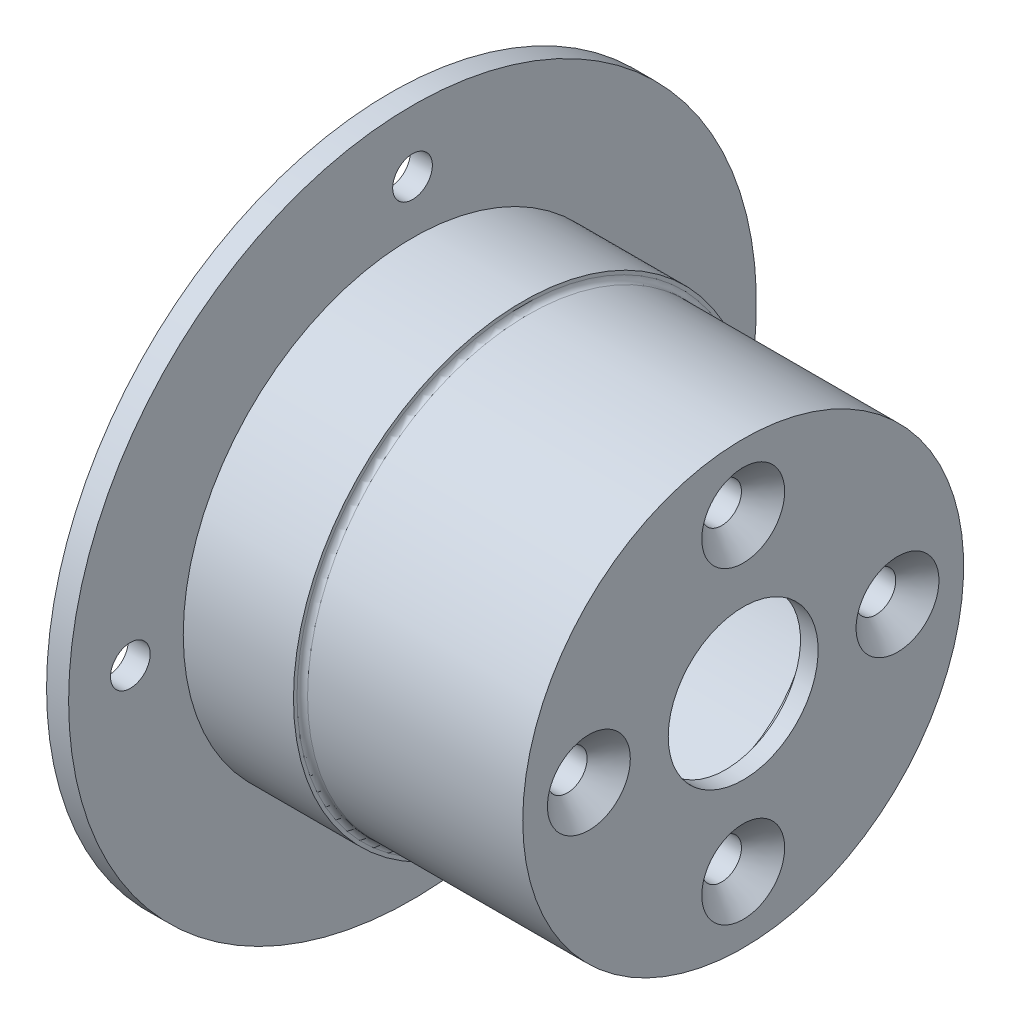
ISO-10303-21;
HEADER;
FILE_DESCRIPTION(('STEP AP214'),'2;1');
FILE_NAME('part.step','',(''),(''),'','','');
FILE_SCHEMA(('AUTOMOTIVE_DESIGN { 1 0 10303 214 1 1 1 1 }'));
ENDSEC;
DATA;
#1=APPLICATION_CONTEXT('core data for automotive mechanical design processes');
#2=APPLICATION_PROTOCOL_DEFINITION('international standard','automotive_design',2000,#1);
#3=PRODUCT_CONTEXT('',#1,'mechanical');
#4=PRODUCT('Part','Part','',(#3));
#5=PRODUCT_RELATED_PRODUCT_CATEGORY('part','',(#4));
#6=PRODUCT_DEFINITION_FORMATION('','',#4);
#7=PRODUCT_DEFINITION_CONTEXT('part definition',#1,'design');
#8=PRODUCT_DEFINITION('design','',#6,#7);
#9=PRODUCT_DEFINITION_SHAPE('','',#8);
#10=(LENGTH_UNIT() NAMED_UNIT(*) SI_UNIT(.MILLI.,.METRE.));
#11=(NAMED_UNIT(*) PLANE_ANGLE_UNIT() SI_UNIT($,.RADIAN.));
#12=(NAMED_UNIT(*) SI_UNIT($,.STERADIAN.) SOLID_ANGLE_UNIT());
#13=UNCERTAINTY_MEASURE_WITH_UNIT(LENGTH_MEASURE(1.E-05),#10,'distance_accuracy_value','');
#14=(GEOMETRIC_REPRESENTATION_CONTEXT(3) GLOBAL_UNCERTAINTY_ASSIGNED_CONTEXT((#13)) GLOBAL_UNIT_ASSIGNED_CONTEXT((#10,
#11,#12)) REPRESENTATION_CONTEXT('',''));
#15=CARTESIAN_POINT('',(0.,0.,0.));
#16=DIRECTION('',(0.,0.,1.));
#17=DIRECTION('',(1.,0.,0.));
#18=AXIS2_PLACEMENT_3D('',#15,#16,#17);
#19=CARTESIAN_POINT('',(0.,39.,0.));
#20=DIRECTION('',(1.,0.,0.));
#21=DIRECTION('',(0.,0.,-1.));
#22=AXIS2_PLACEMENT_3D('',#19,#20,#21);
#23=PLANE('',#22);
#24=CARTESIAN_POINT('',(0.,-32.,0.));
#25=DIRECTION('',(-1.,0.,0.));
#26=DIRECTION('',(0.,0.,1.));
#27=AXIS2_PLACEMENT_3D('',#24,#25,#26);
#28=CIRCLE('',#27,2.25);
#29=CARTESIAN_POINT('',(0.,-32.,2.25));
#30=VERTEX_POINT('',#29);
#31=EDGE_CURVE('E169',#30,#30,#28,.T.);
#32=ORIENTED_EDGE('',*,*,#31,.F.);
#33=EDGE_LOOP('',(#32));
#34=FACE_BOUND('',#33,.T.);
#35=CARTESIAN_POINT('',(0.,0.,-32.));
#36=DIRECTION('',(-1.,0.,0.));
#37=DIRECTION('',(0.,0.,1.));
#38=AXIS2_PLACEMENT_3D('',#35,#36,#37);
#39=CIRCLE('',#38,2.25);
#40=CARTESIAN_POINT('',(0.,0.,-29.75));
#41=VERTEX_POINT('',#40);
#42=EDGE_CURVE('E153',#41,#41,#39,.T.);
#43=ORIENTED_EDGE('',*,*,#42,.F.);
#44=EDGE_LOOP('',(#43));
#45=FACE_BOUND('',#44,.T.);
#46=CARTESIAN_POINT('',(0.,0.,0.));
#47=DIRECTION('',(-1.,0.,0.));
#48=DIRECTION('',(0.,0.,1.));
#49=AXIS2_PLACEMENT_3D('',#46,#47,#48);
#50=CIRCLE('',#49,21.);
#51=CARTESIAN_POINT('',(0.,0.,21.));
#52=VERTEX_POINT('',#51);
#53=EDGE_CURVE('E55',#52,#52,#50,.T.);
#54=ORIENTED_EDGE('',*,*,#53,.F.);
#55=EDGE_LOOP('',(#54));
#56=FACE_BOUND('',#55,.T.);
#57=CARTESIAN_POINT('',(0.,0.,0.));
#58=DIRECTION('',(-1.,0.,0.));
#59=DIRECTION('',(0.,0.,1.));
#60=AXIS2_PLACEMENT_3D('',#57,#58,#59);
#61=CIRCLE('',#60,39.);
#62=CARTESIAN_POINT('',(0.,0.,39.));
#63=VERTEX_POINT('',#62);
#64=EDGE_CURVE('E97',#63,#63,#61,.T.);
#65=ORIENTED_EDGE('',*,*,#64,.T.);
#66=EDGE_LOOP('',(#65));
#67=FACE_BOUND('',#66,.T.);
#68=CARTESIAN_POINT('',(0.,0.,32.));
#69=DIRECTION('',(-1.,0.,0.));
#70=DIRECTION('',(0.,0.,1.));
#71=AXIS2_PLACEMENT_3D('',#68,#69,#70);
#72=CIRCLE('',#71,2.25);
#73=CARTESIAN_POINT('',(0.,0.,34.25));
#74=VERTEX_POINT('',#73);
#75=EDGE_CURVE('E161',#74,#74,#72,.T.);
#76=ORIENTED_EDGE('',*,*,#75,.F.);
#77=EDGE_LOOP('',(#76));
#78=FACE_BOUND('',#77,.T.);
#79=CARTESIAN_POINT('',(0.,32.,0.));
#80=DIRECTION('',(-1.,0.,0.));
#81=DIRECTION('',(0.,0.,1.));
#82=AXIS2_PLACEMENT_3D('',#79,#80,#81);
#83=CIRCLE('',#82,2.25);
#84=CARTESIAN_POINT('',(0.,32.,2.25));
#85=VERTEX_POINT('',#84);
#86=EDGE_CURVE('E177',#85,#85,#83,.T.);
#87=ORIENTED_EDGE('',*,*,#86,.F.);
#88=EDGE_LOOP('',(#87));
#89=FACE_BOUND('',#88,.T.);
#90=ADVANCED_FACE('F41',(#34,#45,#56,#67,#78,#89),#23,.F.);
#91=CARTESIAN_POINT('',(-64.1033524540557,0.,0.));
#92=DIRECTION('',(-1.,0.,0.));
#93=DIRECTION('',(0.,0.,1.));
#94=AXIS2_PLACEMENT_3D('',#91,#92,#93);
#95=CYLINDRICAL_SURFACE('',#94,21.);
#96=CARTESIAN_POINT('',(35.,0.,0.));
#97=DIRECTION('',(-1.,0.,0.));
#98=DIRECTION('',(0.,0.,1.));
#99=AXIS2_PLACEMENT_3D('',#96,#97,#98);
#100=CIRCLE('',#99,21.);
#101=CARTESIAN_POINT('',(35.,0.,21.));
#102=VERTEX_POINT('',#101);
#103=EDGE_CURVE('E61',#102,#102,#100,.T.);
#104=ORIENTED_EDGE('',*,*,#103,.F.);
#105=EDGE_LOOP('',(#104));
#106=FACE_BOUND('',#105,.T.);
#107=ORIENTED_EDGE('',*,*,#53,.T.);
#108=EDGE_LOOP('',(#107));
#109=FACE_BOUND('',#108,.T.);
#110=ADVANCED_FACE('F185',(#106,#109),#95,.F.);
#111=CARTESIAN_POINT('',(35.,21.,0.));
#112=DIRECTION('',(1.,0.,0.));
#113=DIRECTION('',(0.,0.,-1.));
#114=AXIS2_PLACEMENT_3D('',#111,#112,#113);
#115=PLANE('',#114);
#116=CARTESIAN_POINT('',(35.,17.5,0.));
#117=DIRECTION('',(1.,0.,0.));
#118=DIRECTION('',(0.,0.,-1.));
#119=AXIS2_PLACEMENT_3D('',#116,#117,#118);
#120=CIRCLE('',#119,2.24999999999999);
#121=CARTESIAN_POINT('',(35.,17.5,-2.24999999999999));
#122=VERTEX_POINT('',#121);
#123=EDGE_CURVE('E137',#122,#122,#120,.T.);
#124=ORIENTED_EDGE('',*,*,#123,.T.);
#125=EDGE_LOOP('',(#124));
#126=FACE_BOUND('',#125,.T.);
#127=CARTESIAN_POINT('',(35.,0.,-17.5));
#128=DIRECTION('',(1.,0.,0.));
#129=DIRECTION('',(0.,0.,-1.));
#130=AXIS2_PLACEMENT_3D('',#127,#128,#129);
#131=CIRCLE('',#130,2.24999999999999);
#132=CARTESIAN_POINT('',(35.,0.,-19.75));
#133=VERTEX_POINT('',#132);
#134=EDGE_CURVE('E125',#133,#133,#131,.T.);
#135=ORIENTED_EDGE('',*,*,#134,.T.);
#136=EDGE_LOOP('',(#135));
#137=FACE_BOUND('',#136,.T.);
#138=CARTESIAN_POINT('',(35.,-17.5,0.));
#139=DIRECTION('',(1.,0.,0.));
#140=DIRECTION('',(0.,0.,-1.));
#141=AXIS2_PLACEMENT_3D('',#138,#139,#140);
#142=CIRCLE('',#141,2.24999999999999);
#143=CARTESIAN_POINT('',(35.,-17.5,-2.24999999999999));
#144=VERTEX_POINT('',#143);
#145=EDGE_CURVE('E113',#144,#144,#142,.T.);
#146=ORIENTED_EDGE('',*,*,#145,.T.);
#147=EDGE_LOOP('',(#146));
#148=FACE_BOUND('',#147,.T.);
#149=CARTESIAN_POINT('',(35.,0.,17.5));
#150=DIRECTION('',(1.,0.,0.));
#151=DIRECTION('',(0.,0.,-1.));
#152=AXIS2_PLACEMENT_3D('',#149,#150,#151);
#153=CIRCLE('',#152,2.24999999999999);
#154=CARTESIAN_POINT('',(35.,0.,15.25));
#155=VERTEX_POINT('',#154);
#156=EDGE_CURVE('E101',#155,#155,#153,.T.);
#157=ORIENTED_EDGE('',*,*,#156,.T.);
#158=EDGE_LOOP('',(#157));
#159=FACE_BOUND('',#158,.T.);
#160=CARTESIAN_POINT('',(35.,0.,0.));
#161=DIRECTION('',(-1.,0.,0.));
#162=DIRECTION('',(0.,0.,1.));
#163=AXIS2_PLACEMENT_3D('',#160,#161,#162);
#164=CIRCLE('',#163,12.5);
#165=CARTESIAN_POINT('',(35.,0.,12.5));
#166=VERTEX_POINT('',#165);
#167=EDGE_CURVE('E66',#166,#166,#164,.T.);
#168=ORIENTED_EDGE('',*,*,#167,.F.);
#169=EDGE_LOOP('',(#168));
#170=FACE_BOUND('',#169,.T.);
#171=ORIENTED_EDGE('',*,*,#103,.T.);
#172=EDGE_LOOP('',(#171));
#173=FACE_BOUND('',#172,.T.);
#174=ADVANCED_FACE('F191',(#126,#137,#148,#159,#170,#173),#115,.F.);
#175=CARTESIAN_POINT('',(-64.1033524540557,0.,0.));
#176=DIRECTION('',(-1.,0.,0.));
#177=DIRECTION('',(0.,0.,1.));
#178=AXIS2_PLACEMENT_3D('',#175,#176,#177);
#179=CYLINDRICAL_SURFACE('',#178,12.5);
#180=CARTESIAN_POINT('',(38.,0.,0.));
#181=DIRECTION('',(-1.,0.,0.));
#182=DIRECTION('',(0.,0.,1.));
#183=AXIS2_PLACEMENT_3D('',#180,#181,#182);
#184=CIRCLE('',#183,12.5);
#185=CARTESIAN_POINT('',(38.,0.,12.5));
#186=VERTEX_POINT('',#185);
#187=EDGE_CURVE('E70',#186,#186,#184,.T.);
#188=ORIENTED_EDGE('',*,*,#187,.F.);
#189=EDGE_LOOP('',(#188));
#190=FACE_BOUND('',#189,.T.);
#191=ORIENTED_EDGE('',*,*,#167,.T.);
#192=EDGE_LOOP('',(#191));
#193=FACE_BOUND('',#192,.T.);
#194=ADVANCED_FACE('F228',(#190,#193),#179,.F.);
#195=CARTESIAN_POINT('',(38.,12.5,0.));
#196=DIRECTION('',(1.,0.,0.));
#197=DIRECTION('',(0.,0.,-1.));
#198=AXIS2_PLACEMENT_3D('',#195,#196,#197);
#199=PLANE('',#198);
#200=CARTESIAN_POINT('',(38.,0.,0.));
#201=DIRECTION('',(-1.,0.,0.));
#202=DIRECTION('',(0.,0.,1.));
#203=AXIS2_PLACEMENT_3D('',#200,#201,#202);
#204=CIRCLE('',#203,8.5);
#205=CARTESIAN_POINT('',(38.,0.,8.5));
#206=VERTEX_POINT('',#205);
#207=EDGE_CURVE('E74',#206,#206,#204,.T.);
#208=ORIENTED_EDGE('',*,*,#207,.F.);
#209=EDGE_LOOP('',(#208));
#210=FACE_BOUND('',#209,.T.);
#211=ORIENTED_EDGE('',*,*,#187,.T.);
#212=EDGE_LOOP('',(#211));
#213=FACE_BOUND('',#212,.T.);
#214=ADVANCED_FACE('F224',(#210,#213),#199,.F.);
#215=CARTESIAN_POINT('',(-64.1033524540557,0.,0.));
#216=DIRECTION('',(-1.,0.,0.));
#217=DIRECTION('',(0.,0.,1.));
#218=AXIS2_PLACEMENT_3D('',#215,#216,#217);
#219=CYLINDRICAL_SURFACE('',#218,8.5);
#220=CARTESIAN_POINT('',(40.,0.,0.));
#221=DIRECTION('',(-1.,0.,0.));
#222=DIRECTION('',(0.,0.,1.));
#223=AXIS2_PLACEMENT_3D('',#220,#221,#222);
#224=CIRCLE('',#223,8.5);
#225=CARTESIAN_POINT('',(40.,0.,8.5));
#226=VERTEX_POINT('',#225);
#227=EDGE_CURVE('E78',#226,#226,#224,.T.);
#228=ORIENTED_EDGE('',*,*,#227,.F.);
#229=EDGE_LOOP('',(#228));
#230=FACE_BOUND('',#229,.T.);
#231=ORIENTED_EDGE('',*,*,#207,.T.);
#232=EDGE_LOOP('',(#231));
#233=FACE_BOUND('',#232,.T.);
#234=ADVANCED_FACE('F220',(#230,#233),#219,.F.);
#235=CARTESIAN_POINT('',(40.,8.5,0.));
#236=DIRECTION('',(-1.,0.,0.));
#237=DIRECTION('',(0.,0.,1.));
#238=AXIS2_PLACEMENT_3D('',#235,#236,#237);
#239=PLANE('',#238);
#240=CARTESIAN_POINT('',(40.,17.5,0.));
#241=DIRECTION('',(1.,0.,0.));
#242=DIRECTION('',(0.,0.,-1.));
#243=AXIS2_PLACEMENT_3D('',#240,#241,#242);
#244=CIRCLE('',#243,4.7);
#245=CARTESIAN_POINT('',(40.,17.5,-4.7));
#246=VERTEX_POINT('',#245);
#247=EDGE_CURVE('E145',#246,#246,#244,.T.);
#248=ORIENTED_EDGE('',*,*,#247,.F.);
#249=EDGE_LOOP('',(#248));
#250=FACE_BOUND('',#249,.T.);
#251=CARTESIAN_POINT('',(40.,0.,-17.5));
#252=DIRECTION('',(1.,0.,0.));
#253=DIRECTION('',(0.,0.,-1.));
#254=AXIS2_PLACEMENT_3D('',#251,#252,#253);
#255=CIRCLE('',#254,4.7);
#256=CARTESIAN_POINT('',(40.,0.,-22.2));
#257=VERTEX_POINT('',#256);
#258=EDGE_CURVE('E133',#257,#257,#255,.T.);
#259=ORIENTED_EDGE('',*,*,#258,.F.);
#260=EDGE_LOOP('',(#259));
#261=FACE_BOUND('',#260,.T.);
#262=CARTESIAN_POINT('',(40.,-17.5,0.));
#263=DIRECTION('',(1.,0.,0.));
#264=DIRECTION('',(0.,0.,-1.));
#265=AXIS2_PLACEMENT_3D('',#262,#263,#264);
#266=CIRCLE('',#265,4.7);
#267=CARTESIAN_POINT('',(40.,-17.5,-4.7));
#268=VERTEX_POINT('',#267);
#269=EDGE_CURVE('E121',#268,#268,#266,.T.);
#270=ORIENTED_EDGE('',*,*,#269,.F.);
#271=EDGE_LOOP('',(#270));
#272=FACE_BOUND('',#271,.T.);
#273=CARTESIAN_POINT('',(40.,0.,17.5));
#274=DIRECTION('',(1.,0.,0.));
#275=DIRECTION('',(0.,0.,-1.));
#276=AXIS2_PLACEMENT_3D('',#273,#274,#275);
#277=CIRCLE('',#276,4.7);
#278=CARTESIAN_POINT('',(40.,0.,12.8));
#279=VERTEX_POINT('',#278);
#280=EDGE_CURVE('E109',#279,#279,#277,.T.);
#281=ORIENTED_EDGE('',*,*,#280,.F.);
#282=EDGE_LOOP('',(#281));
#283=FACE_BOUND('',#282,.T.);
#284=CARTESIAN_POINT('',(40.,0.,0.));
#285=DIRECTION('',(-1.,0.,0.));
#286=DIRECTION('',(0.,0.,1.));
#287=AXIS2_PLACEMENT_3D('',#284,#285,#286);
#288=CIRCLE('',#287,25.);
#289=CARTESIAN_POINT('',(40.,0.,25.));
#290=VERTEX_POINT('',#289);
#291=EDGE_CURVE('E82',#290,#290,#288,.T.);
#292=ORIENTED_EDGE('',*,*,#291,.F.);
#293=EDGE_LOOP('',(#292));
#294=FACE_BOUND('',#293,.T.);
#295=ORIENTED_EDGE('',*,*,#227,.T.);
#296=EDGE_LOOP('',(#295));
#297=FACE_BOUND('',#296,.T.);
#298=ADVANCED_FACE('F217',(#250,#261,#272,#283,#294,#297),#239,.F.);
#299=CARTESIAN_POINT('',(-64.1033524540557,0.,0.));
#300=DIRECTION('',(-1.,0.,0.));
#301=DIRECTION('',(0.,0.,1.));
#302=AXIS2_PLACEMENT_3D('',#299,#300,#301);
#303=CYLINDRICAL_SURFACE('',#302,25.);
#304=CARTESIAN_POINT('',(15.6,0.,0.));
#305=DIRECTION('',(-1.,0.,0.));
#306=DIRECTION('',(0.,0.,1.));
#307=AXIS2_PLACEMENT_3D('',#304,#305,#306);
#308=CIRCLE('',#307,25.);
#309=CARTESIAN_POINT('',(15.6,0.,25.));
#310=VERTEX_POINT('',#309);
#311=EDGE_CURVE('E10',#310,#310,#308,.F.);
#312=ORIENTED_EDGE('',*,*,#311,.T.);
#313=EDGE_LOOP('',(#312));
#314=FACE_BOUND('',#313,.T.);
#315=ORIENTED_EDGE('',*,*,#291,.T.);
#316=EDGE_LOOP('',(#315));
#317=FACE_BOUND('',#316,.T.);
#318=ADVANCED_FACE('F214',(#314,#317),#303,.T.);
#319=CARTESIAN_POINT('',(15.,25.,0.));
#320=DIRECTION('',(-1.,0.,0.));
#321=DIRECTION('',(0.,0.,1.));
#322=AXIS2_PLACEMENT_3D('',#319,#320,#321);
#323=PLANE('',#322);
#324=CARTESIAN_POINT('',(15.,0.,0.));
#325=DIRECTION('',(-1.,0.,0.));
#326=DIRECTION('',(0.,0.,1.));
#327=AXIS2_PLACEMENT_3D('',#324,#325,#326);
#328=CIRCLE('',#327,25.6);
#329=CARTESIAN_POINT('',(15.,0.,25.6));
#330=VERTEX_POINT('',#329);
#331=EDGE_CURVE('E49',#330,#330,#328,.T.);
#332=ORIENTED_EDGE('',*,*,#331,.T.);
#333=EDGE_LOOP('',(#332));
#334=FACE_BOUND('',#333,.T.);
#335=CARTESIAN_POINT('',(15.,0.,0.));
#336=DIRECTION('',(-1.,0.,0.));
#337=DIRECTION('',(0.,0.,1.));
#338=AXIS2_PLACEMENT_3D('',#335,#336,#337);
#339=CIRCLE('',#338,26.);
#340=CARTESIAN_POINT('',(15.,0.,26.));
#341=VERTEX_POINT('',#340);
#342=EDGE_CURVE('E86',#341,#341,#339,.T.);
#343=ORIENTED_EDGE('',*,*,#342,.F.);
#344=EDGE_LOOP('',(#343));
#345=FACE_BOUND('',#344,.T.);
#346=ADVANCED_FACE('F210',(#334,#345),#323,.F.);
#347=CARTESIAN_POINT('',(-64.1033524540557,0.,0.));
#348=DIRECTION('',(-1.,0.,0.));
#349=DIRECTION('',(0.,0.,1.));
#350=AXIS2_PLACEMENT_3D('',#347,#348,#349);
#351=CYLINDRICAL_SURFACE('',#350,26.);
#352=CARTESIAN_POINT('',(2.5,0.,0.));
#353=DIRECTION('',(-1.,0.,0.));
#354=DIRECTION('',(0.,0.,1.));
#355=AXIS2_PLACEMENT_3D('',#352,#353,#354);
#356=CIRCLE('',#355,26.);
#357=CARTESIAN_POINT('',(2.5,0.,26.));
#358=VERTEX_POINT('',#357);
#359=EDGE_CURVE('E89',#358,#358,#356,.T.);
#360=ORIENTED_EDGE('',*,*,#359,.F.);
#361=EDGE_LOOP('',(#360));
#362=FACE_BOUND('',#361,.T.);
#363=ORIENTED_EDGE('',*,*,#342,.T.);
#364=EDGE_LOOP('',(#363));
#365=FACE_BOUND('',#364,.T.);
#366=ADVANCED_FACE('F206',(#362,#365),#351,.T.);
#367=CARTESIAN_POINT('',(2.5,26.,0.));
#368=DIRECTION('',(-1.,0.,0.));
#369=DIRECTION('',(0.,0.,1.));
#370=AXIS2_PLACEMENT_3D('',#367,#368,#369);
#371=PLANE('',#370);
#372=CARTESIAN_POINT('',(2.5,32.,0.));
#373=DIRECTION('',(-1.,0.,0.));
#374=DIRECTION('',(0.,0.,1.));
#375=AXIS2_PLACEMENT_3D('',#372,#373,#374);
#376=CIRCLE('',#375,2.25);
#377=CARTESIAN_POINT('',(2.5,32.,2.25));
#378=VERTEX_POINT('',#377);
#379=EDGE_CURVE('E173',#378,#378,#376,.T.);
#380=ORIENTED_EDGE('',*,*,#379,.T.);
#381=EDGE_LOOP('',(#380));
#382=FACE_BOUND('',#381,.T.);
#383=CARTESIAN_POINT('',(2.5,-32.,0.));
#384=DIRECTION('',(-1.,0.,0.));
#385=DIRECTION('',(0.,0.,1.));
#386=AXIS2_PLACEMENT_3D('',#383,#384,#385);
#387=CIRCLE('',#386,2.25);
#388=CARTESIAN_POINT('',(2.5,-32.,2.25));
#389=VERTEX_POINT('',#388);
#390=EDGE_CURVE('E165',#389,#389,#387,.T.);
#391=ORIENTED_EDGE('',*,*,#390,.T.);
#392=EDGE_LOOP('',(#391));
#393=FACE_BOUND('',#392,.T.);
#394=CARTESIAN_POINT('',(2.5,0.,32.));
#395=DIRECTION('',(-1.,0.,0.));
#396=DIRECTION('',(0.,0.,1.));
#397=AXIS2_PLACEMENT_3D('',#394,#395,#396);
#398=CIRCLE('',#397,2.25);
#399=CARTESIAN_POINT('',(2.5,0.,34.25));
#400=VERTEX_POINT('',#399);
#401=EDGE_CURVE('E157',#400,#400,#398,.T.);
#402=ORIENTED_EDGE('',*,*,#401,.T.);
#403=EDGE_LOOP('',(#402));
#404=FACE_BOUND('',#403,.T.);
#405=CARTESIAN_POINT('',(2.5,0.,-32.));
#406=DIRECTION('',(-1.,0.,0.));
#407=DIRECTION('',(0.,0.,1.));
#408=AXIS2_PLACEMENT_3D('',#405,#406,#407);
#409=CIRCLE('',#408,2.25);
#410=CARTESIAN_POINT('',(2.5,0.,-29.75));
#411=VERTEX_POINT('',#410);
#412=EDGE_CURVE('E149',#411,#411,#409,.T.);
#413=ORIENTED_EDGE('',*,*,#412,.T.);
#414=EDGE_LOOP('',(#413));
#415=FACE_BOUND('',#414,.T.);
#416=CARTESIAN_POINT('',(2.5,0.,0.));
#417=DIRECTION('',(-1.,0.,0.));
#418=DIRECTION('',(0.,0.,1.));
#419=AXIS2_PLACEMENT_3D('',#416,#417,#418);
#420=CIRCLE('',#419,39.);
#421=CARTESIAN_POINT('',(2.5,0.,39.));
#422=VERTEX_POINT('',#421);
#423=EDGE_CURVE('E93',#422,#422,#420,.T.);
#424=ORIENTED_EDGE('',*,*,#423,.F.);
#425=EDGE_LOOP('',(#424));
#426=FACE_BOUND('',#425,.T.);
#427=ORIENTED_EDGE('',*,*,#359,.T.);
#428=EDGE_LOOP('',(#427));
#429=FACE_BOUND('',#428,.T.);
#430=ADVANCED_FACE('F202',(#382,#393,#404,#415,#426,#429),#371,.F.);
#431=CARTESIAN_POINT('',(-64.1033524540557,0.,0.));
#432=DIRECTION('',(-1.,0.,0.));
#433=DIRECTION('',(0.,0.,1.));
#434=AXIS2_PLACEMENT_3D('',#431,#432,#433);
#435=CYLINDRICAL_SURFACE('',#434,39.);
#436=ORIENTED_EDGE('',*,*,#64,.F.);
#437=EDGE_LOOP('',(#436));
#438=FACE_BOUND('',#437,.T.);
#439=ORIENTED_EDGE('',*,*,#423,.T.);
#440=EDGE_LOOP('',(#439));
#441=FACE_BOUND('',#440,.T.);
#442=ADVANCED_FACE('F199',(#438,#441),#435,.T.);
#443=CARTESIAN_POINT('',(40.,0.,17.5));
#444=DIRECTION('',(1.,0.,0.));
#445=DIRECTION('',(0.,0.,-1.));
#446=AXIS2_PLACEMENT_3D('',#443,#444,#445);
#447=CYLINDRICAL_SURFACE('',#446,2.24999999999999);
#448=ORIENTED_EDGE('',*,*,#156,.F.);
#449=EDGE_LOOP('',(#448));
#450=FACE_BOUND('',#449,.T.);
#451=CARTESIAN_POINT('',(37.55,0.,17.5));
#452=DIRECTION('',(1.,0.,0.));
#453=DIRECTION('',(0.,0.,-1.));
#454=AXIS2_PLACEMENT_3D('',#451,#452,#453);
#455=CIRCLE('',#454,2.24999999999999);
#456=CARTESIAN_POINT('',(37.55,0.,15.25));
#457=VERTEX_POINT('',#456);
#458=EDGE_CURVE('E105',#457,#457,#455,.T.);
#459=ORIENTED_EDGE('',*,*,#458,.T.);
#460=EDGE_LOOP('',(#459));
#461=FACE_BOUND('',#460,.T.);
#462=ADVANCED_FACE('F197',(#450,#461),#447,.F.);
#463=CARTESIAN_POINT('',(40.,0.,17.5));
#464=DIRECTION('',(1.,0.,0.));
#465=DIRECTION('',(0.,0.,-1.));
#466=AXIS2_PLACEMENT_3D('',#463,#464,#465);
#467=CONICAL_SURFACE('',#466,4.7,0.785398163397449);
#468=ORIENTED_EDGE('',*,*,#458,.F.);
#469=EDGE_LOOP('',(#468));
#470=FACE_BOUND('',#469,.T.);
#471=ORIENTED_EDGE('',*,*,#280,.T.);
#472=EDGE_LOOP('',(#471));
#473=FACE_BOUND('',#472,.T.);
#474=ADVANCED_FACE('F295',(#470,#473),#467,.F.);
#475=CARTESIAN_POINT('',(40.,-17.5,0.));
#476=DIRECTION('',(1.,0.,0.));
#477=DIRECTION('',(0.,0.,-1.));
#478=AXIS2_PLACEMENT_3D('',#475,#476,#477);
#479=CYLINDRICAL_SURFACE('',#478,2.24999999999999);
#480=ORIENTED_EDGE('',*,*,#145,.F.);
#481=EDGE_LOOP('',(#480));
#482=FACE_BOUND('',#481,.T.);
#483=CARTESIAN_POINT('',(37.55,-17.5,0.));
#484=DIRECTION('',(1.,0.,0.));
#485=DIRECTION('',(0.,0.,-1.));
#486=AXIS2_PLACEMENT_3D('',#483,#484,#485);
#487=CIRCLE('',#486,2.24999999999999);
#488=CARTESIAN_POINT('',(37.55,-17.5,-2.24999999999999));
#489=VERTEX_POINT('',#488);
#490=EDGE_CURVE('E117',#489,#489,#487,.T.);
#491=ORIENTED_EDGE('',*,*,#490,.T.);
#492=EDGE_LOOP('',(#491));
#493=FACE_BOUND('',#492,.T.);
#494=ADVANCED_FACE('F292',(#482,#493),#479,.F.);
#495=CARTESIAN_POINT('',(40.,-17.5,0.));
#496=DIRECTION('',(1.,0.,0.));
#497=DIRECTION('',(0.,0.,-1.));
#498=AXIS2_PLACEMENT_3D('',#495,#496,#497);
#499=CONICAL_SURFACE('',#498,4.7,0.785398163397449);
#500=ORIENTED_EDGE('',*,*,#490,.F.);
#501=EDGE_LOOP('',(#500));
#502=FACE_BOUND('',#501,.T.);
#503=ORIENTED_EDGE('',*,*,#269,.T.);
#504=EDGE_LOOP('',(#503));
#505=FACE_BOUND('',#504,.T.);
#506=ADVANCED_FACE('F288',(#502,#505),#499,.F.);
#507=CARTESIAN_POINT('',(40.,0.,-17.5));
#508=DIRECTION('',(1.,0.,0.));
#509=DIRECTION('',(0.,0.,-1.));
#510=AXIS2_PLACEMENT_3D('',#507,#508,#509);
#511=CYLINDRICAL_SURFACE('',#510,2.24999999999999);
#512=ORIENTED_EDGE('',*,*,#134,.F.);
#513=EDGE_LOOP('',(#512));
#514=FACE_BOUND('',#513,.T.);
#515=CARTESIAN_POINT('',(37.55,0.,-17.5));
#516=DIRECTION('',(1.,0.,0.));
#517=DIRECTION('',(0.,0.,-1.));
#518=AXIS2_PLACEMENT_3D('',#515,#516,#517);
#519=CIRCLE('',#518,2.24999999999999);
#520=CARTESIAN_POINT('',(37.55,0.,-19.75));
#521=VERTEX_POINT('',#520);
#522=EDGE_CURVE('E129',#521,#521,#519,.T.);
#523=ORIENTED_EDGE('',*,*,#522,.T.);
#524=EDGE_LOOP('',(#523));
#525=FACE_BOUND('',#524,.T.);
#526=ADVANCED_FACE('F284',(#514,#525),#511,.F.);
#527=CARTESIAN_POINT('',(40.,0.,-17.5));
#528=DIRECTION('',(1.,0.,0.));
#529=DIRECTION('',(0.,0.,-1.));
#530=AXIS2_PLACEMENT_3D('',#527,#528,#529);
#531=CONICAL_SURFACE('',#530,4.7,0.785398163397449);
#532=ORIENTED_EDGE('',*,*,#522,.F.);
#533=EDGE_LOOP('',(#532));
#534=FACE_BOUND('',#533,.T.);
#535=ORIENTED_EDGE('',*,*,#258,.T.);
#536=EDGE_LOOP('',(#535));
#537=FACE_BOUND('',#536,.T.);
#538=ADVANCED_FACE('F280',(#534,#537),#531,.F.);
#539=CARTESIAN_POINT('',(40.,17.5,0.));
#540=DIRECTION('',(1.,0.,0.));
#541=DIRECTION('',(0.,0.,-1.));
#542=AXIS2_PLACEMENT_3D('',#539,#540,#541);
#543=CYLINDRICAL_SURFACE('',#542,2.24999999999999);
#544=ORIENTED_EDGE('',*,*,#123,.F.);
#545=EDGE_LOOP('',(#544));
#546=FACE_BOUND('',#545,.T.);
#547=CARTESIAN_POINT('',(37.55,17.5,0.));
#548=DIRECTION('',(1.,0.,0.));
#549=DIRECTION('',(0.,0.,-1.));
#550=AXIS2_PLACEMENT_3D('',#547,#548,#549);
#551=CIRCLE('',#550,2.24999999999999);
#552=CARTESIAN_POINT('',(37.55,17.5,-2.24999999999999));
#553=VERTEX_POINT('',#552);
#554=EDGE_CURVE('E141',#553,#553,#551,.T.);
#555=ORIENTED_EDGE('',*,*,#554,.T.);
#556=EDGE_LOOP('',(#555));
#557=FACE_BOUND('',#556,.T.);
#558=ADVANCED_FACE('F276',(#546,#557),#543,.F.);
#559=CARTESIAN_POINT('',(40.,17.5,0.));
#560=DIRECTION('',(1.,0.,0.));
#561=DIRECTION('',(0.,0.,-1.));
#562=AXIS2_PLACEMENT_3D('',#559,#560,#561);
#563=CONICAL_SURFACE('',#562,4.7,0.785398163397449);
#564=ORIENTED_EDGE('',*,*,#554,.F.);
#565=EDGE_LOOP('',(#564));
#566=FACE_BOUND('',#565,.T.);
#567=ORIENTED_EDGE('',*,*,#247,.T.);
#568=EDGE_LOOP('',(#567));
#569=FACE_BOUND('',#568,.T.);
#570=ADVANCED_FACE('F273',(#566,#569),#563,.F.);
#571=CARTESIAN_POINT('',(15.6,0.,0.));
#572=DIRECTION('',(-1.,0.,0.));
#573=DIRECTION('',(0.,0.,1.));
#574=AXIS2_PLACEMENT_3D('',#571,#572,#573);
#575=TOROIDAL_SURFACE('',#574,25.6,0.6);
#576=ORIENTED_EDGE('',*,*,#311,.F.);
#577=EDGE_LOOP('',(#576));
#578=FACE_BOUND('',#577,.T.);
#579=ORIENTED_EDGE('',*,*,#331,.F.);
#580=EDGE_LOOP('',(#579));
#581=FACE_BOUND('',#580,.T.);
#582=ADVANCED_FACE('F43',(#578,#581),#575,.F.);
#583=CARTESIAN_POINT('',(0.,0.,-32.));
#584=DIRECTION('',(-1.,0.,0.));
#585=DIRECTION('',(0.,0.,1.));
#586=AXIS2_PLACEMENT_3D('',#583,#584,#585);
#587=CYLINDRICAL_SURFACE('',#586,2.25);
#588=ORIENTED_EDGE('',*,*,#412,.F.);
#589=EDGE_LOOP('',(#588));
#590=FACE_BOUND('',#589,.T.);
#591=ORIENTED_EDGE('',*,*,#42,.T.);
#592=EDGE_LOOP('',(#591));
#593=FACE_BOUND('',#592,.T.);
#594=ADVANCED_FACE('F259',(#590,#593),#587,.F.);
#595=CARTESIAN_POINT('',(0.,0.,32.));
#596=DIRECTION('',(-1.,0.,0.));
#597=DIRECTION('',(0.,0.,1.));
#598=AXIS2_PLACEMENT_3D('',#595,#596,#597);
#599=CYLINDRICAL_SURFACE('',#598,2.25);
#600=ORIENTED_EDGE('',*,*,#401,.F.);
#601=EDGE_LOOP('',(#600));
#602=FACE_BOUND('',#601,.T.);
#603=ORIENTED_EDGE('',*,*,#75,.T.);
#604=EDGE_LOOP('',(#603));
#605=FACE_BOUND('',#604,.T.);
#606=ADVANCED_FACE('F256',(#602,#605),#599,.F.);
#607=CARTESIAN_POINT('',(0.,-32.,0.));
#608=DIRECTION('',(-1.,0.,0.));
#609=DIRECTION('',(0.,0.,1.));
#610=AXIS2_PLACEMENT_3D('',#607,#608,#609);
#611=CYLINDRICAL_SURFACE('',#610,2.25);
#612=ORIENTED_EDGE('',*,*,#390,.F.);
#613=EDGE_LOOP('',(#612));
#614=FACE_BOUND('',#613,.T.);
#615=ORIENTED_EDGE('',*,*,#31,.T.);
#616=EDGE_LOOP('',(#615));
#617=FACE_BOUND('',#616,.T.);
#618=ADVANCED_FACE('F258',(#614,#617),#611,.F.);
#619=CARTESIAN_POINT('',(0.,32.,0.));
#620=DIRECTION('',(-1.,0.,0.));
#621=DIRECTION('',(0.,0.,1.));
#622=AXIS2_PLACEMENT_3D('',#619,#620,#621);
#623=CYLINDRICAL_SURFACE('',#622,2.25);
#624=ORIENTED_EDGE('',*,*,#379,.F.);
#625=EDGE_LOOP('',(#624));
#626=FACE_BOUND('',#625,.T.);
#627=ORIENTED_EDGE('',*,*,#86,.T.);
#628=EDGE_LOOP('',(#627));
#629=FACE_BOUND('',#628,.T.);
#630=ADVANCED_FACE('F182',(#626,#629),#623,.F.);
#631=CLOSED_SHELL('',(#90,#110,#174,#194,#214,#234,#298,#318,#346,#366,#430,#442,#462,#474,#494,
#506,#526,#538,#558,#570,#582,#594,#606,#618,#630));
#632=MANIFOLD_SOLID_BREP('B2',#631);
#633=ADVANCED_BREP_SHAPE_REPRESENTATION('',(#18,#632),#14);
#634=SHAPE_DEFINITION_REPRESENTATION(#9,#633);
ENDSEC;
END-ISO-10303-21;
